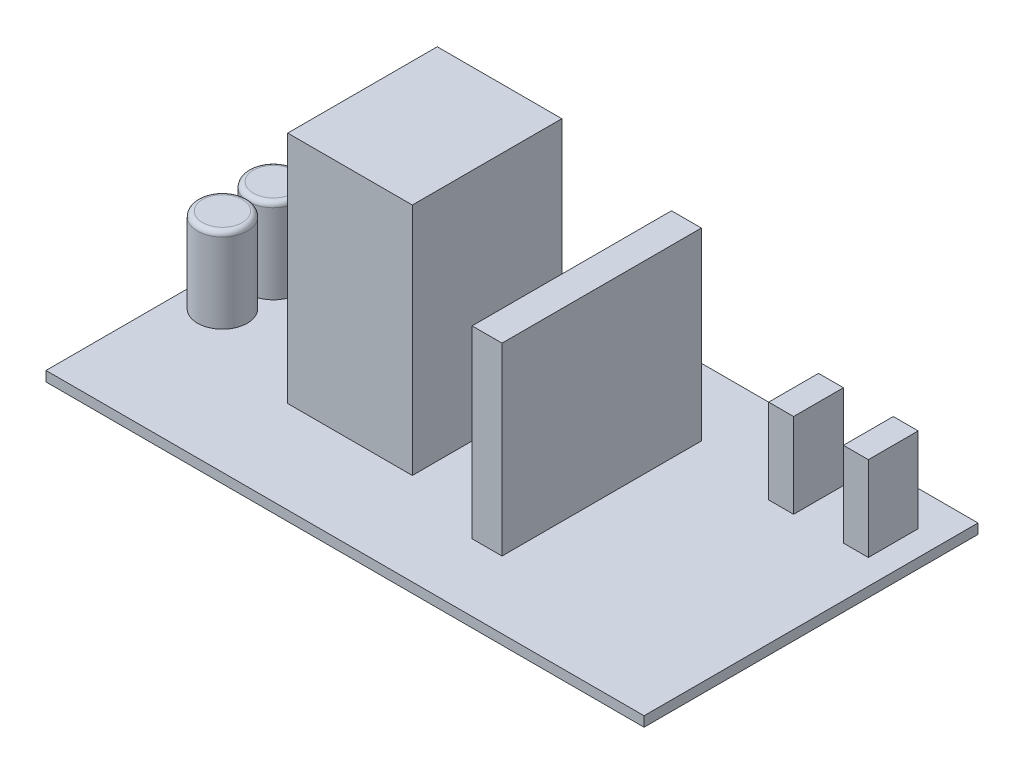
ISO-10303-21;
HEADER;
FILE_DESCRIPTION(('STEP AP214'),'2;1');
FILE_NAME('part.step','',(''),(''),'','','');
FILE_SCHEMA(('AUTOMOTIVE_DESIGN { 1 0 10303 214 1 1 1 1 }'));
ENDSEC;
DATA;
#1=APPLICATION_CONTEXT('core data for automotive mechanical design processes');
#2=APPLICATION_PROTOCOL_DEFINITION('international standard','automotive_design',2000,#1);
#3=PRODUCT_CONTEXT('',#1,'mechanical');
#4=PRODUCT('Part','Part','',(#3));
#5=PRODUCT_RELATED_PRODUCT_CATEGORY('part','',(#4));
#6=PRODUCT_DEFINITION_FORMATION('','',#4);
#7=PRODUCT_DEFINITION_CONTEXT('part definition',#1,'design');
#8=PRODUCT_DEFINITION('design','',#6,#7);
#9=PRODUCT_DEFINITION_SHAPE('','',#8);
#10=(LENGTH_UNIT() NAMED_UNIT(*) SI_UNIT(.MILLI.,.METRE.));
#11=(NAMED_UNIT(*) PLANE_ANGLE_UNIT() SI_UNIT($,.RADIAN.));
#12=(NAMED_UNIT(*) SI_UNIT($,.STERADIAN.) SOLID_ANGLE_UNIT());
#13=UNCERTAINTY_MEASURE_WITH_UNIT(LENGTH_MEASURE(1.E-05),#10,'distance_accuracy_value','');
#14=(GEOMETRIC_REPRESENTATION_CONTEXT(3) GLOBAL_UNCERTAINTY_ASSIGNED_CONTEXT((#13)) GLOBAL_UNIT_ASSIGNED_CONTEXT((#10,
#11,#12)) REPRESENTATION_CONTEXT('',''));
#15=CARTESIAN_POINT('',(0.,0.,0.));
#16=DIRECTION('',(0.,0.,1.));
#17=DIRECTION('',(1.,0.,0.));
#18=AXIS2_PLACEMENT_3D('',#15,#16,#17);
#19=CARTESIAN_POINT('',(0.,2.,0.));
#20=DIRECTION('',(0.,1.,0.));
#21=DIRECTION('',(0.,0.,1.));
#22=AXIS2_PLACEMENT_3D('',#19,#20,#21);
#23=PLANE('',#22);
#24=DIRECTION('',(0.,0.,1.));
#25=VECTOR('',#24,1.);
#26=CARTESIAN_POINT('',(35.,2.,0.));
#27=LINE('',#26,#25);
#28=CARTESIAN_POINT('',(35.,2.,-26.5));
#29=VERTEX_POINT('',#28);
#30=CARTESIAN_POINT('',(35.,2.,-16.5));
#31=VERTEX_POINT('',#30);
#32=EDGE_CURVE('E196',#29,#31,#27,.T.);
#33=ORIENTED_EDGE('',*,*,#32,.F.);
#34=DIRECTION('',(-1.,0.,0.));
#35=VECTOR('',#34,1.);
#36=CARTESIAN_POINT('',(0.,2.,-26.5));
#37=LINE('',#36,#35);
#38=CARTESIAN_POINT('',(40.,2.,-26.5));
#39=VERTEX_POINT('',#38);
#40=EDGE_CURVE('E193',#39,#29,#37,.T.);
#41=ORIENTED_EDGE('',*,*,#40,.F.);
#42=DIRECTION('',(0.,0.,1.));
#43=VECTOR('',#42,1.);
#44=CARTESIAN_POINT('',(40.,2.,0.));
#45=LINE('',#44,#43);
#46=CARTESIAN_POINT('',(40.,2.,-16.5));
#47=VERTEX_POINT('',#46);
#48=EDGE_CURVE('E206',#39,#47,#45,.T.);
#49=ORIENTED_EDGE('',*,*,#48,.T.);
#50=DIRECTION('',(-1.,0.,0.));
#51=VECTOR('',#50,1.);
#52=CARTESIAN_POINT('',(0.,2.,-16.5));
#53=LINE('',#52,#51);
#54=EDGE_CURVE('E217',#47,#31,#53,.T.);
#55=ORIENTED_EDGE('',*,*,#54,.T.);
#56=EDGE_LOOP('',(#33,#41,#49,#55));
#57=FACE_BOUND('',#56,.T.);
#58=DIRECTION('',(0.,0.,1.));
#59=VECTOR('',#58,1.);
#60=CARTESIAN_POINT('',(18.,2.,0.));
#61=LINE('',#60,#59);
#62=CARTESIAN_POINT('',(18.,2.,-20.));
#63=VERTEX_POINT('',#62);
#64=CARTESIAN_POINT('',(18.,2.,20.));
#65=VERTEX_POINT('',#64);
#66=EDGE_CURVE('E231',#63,#65,#61,.T.);
#67=ORIENTED_EDGE('',*,*,#66,.T.);
#68=DIRECTION('',(1.,0.,0.));
#69=VECTOR('',#68,1.);
#70=CARTESIAN_POINT('',(0.,2.,20.));
#71=LINE('',#70,#69);
#72=CARTESIAN_POINT('',(12.,2.,20.));
#73=VERTEX_POINT('',#72);
#74=EDGE_CURVE('E236',#73,#65,#71,.T.);
#75=ORIENTED_EDGE('',*,*,#74,.F.);
#76=DIRECTION('',(0.,0.,1.));
#77=VECTOR('',#76,1.);
#78=CARTESIAN_POINT('',(12.,2.,0.));
#79=LINE('',#78,#77);
#80=CARTESIAN_POINT('',(12.,2.,-20.));
#81=VERTEX_POINT('',#80);
#82=EDGE_CURVE('E249',#81,#73,#79,.T.);
#83=ORIENTED_EDGE('',*,*,#82,.F.);
#84=DIRECTION('',(1.,0.,0.));
#85=VECTOR('',#84,1.);
#86=CARTESIAN_POINT('',(0.,2.,-20.));
#87=LINE('',#86,#85);
#88=EDGE_CURVE('E246',#81,#63,#87,.T.);
#89=ORIENTED_EDGE('',*,*,#88,.T.);
#90=EDGE_LOOP('',(#67,#75,#83,#89));
#91=FACE_BOUND('',#90,.T.);
#92=DIRECTION('',(0.,0.,1.));
#93=VECTOR('',#92,1.);
#94=CARTESIAN_POINT('',(-5.,2.,0.));
#95=LINE('',#94,#93);
#96=CARTESIAN_POINT('',(-5.,2.,-15.));
#97=VERTEX_POINT('',#96);
#98=CARTESIAN_POINT('',(-5.,2.,15.));
#99=VERTEX_POINT('',#98);
#100=EDGE_CURVE('E261',#97,#99,#95,.T.);
#101=ORIENTED_EDGE('',*,*,#100,.T.);
#102=DIRECTION('',(1.,0.,0.));
#103=VECTOR('',#102,1.);
#104=CARTESIAN_POINT('',(0.,2.,15.));
#105=LINE('',#104,#103);
#106=CARTESIAN_POINT('',(-30.,2.,15.));
#107=VERTEX_POINT('',#106);
#108=EDGE_CURVE('E266',#107,#99,#105,.T.);
#109=ORIENTED_EDGE('',*,*,#108,.F.);
#110=DIRECTION('',(0.,0.,1.));
#111=VECTOR('',#110,1.);
#112=CARTESIAN_POINT('',(-30.,2.,0.));
#113=LINE('',#112,#111);
#114=CARTESIAN_POINT('',(-30.,2.,-15.));
#115=VERTEX_POINT('',#114);
#116=EDGE_CURVE('E279',#115,#107,#113,.T.);
#117=ORIENTED_EDGE('',*,*,#116,.F.);
#118=DIRECTION('',(1.,0.,0.));
#119=VECTOR('',#118,1.);
#120=CARTESIAN_POINT('',(0.,2.,-15.));
#121=LINE('',#120,#119);
#122=EDGE_CURVE('E276',#115,#97,#121,.T.);
#123=ORIENTED_EDGE('',*,*,#122,.T.);
#124=EDGE_LOOP('',(#101,#109,#117,#123));
#125=FACE_BOUND('',#124,.T.);
#126=CARTESIAN_POINT('',(-53.,2.,-5.1));
#127=DIRECTION('',(0.,1.,0.));
#128=DIRECTION('',(0.,0.,1.));
#129=AXIS2_PLACEMENT_3D('',#126,#127,#128);
#130=CIRCLE('',#129,5.);
#131=CARTESIAN_POINT('',(-53.,2.,-0.100000000000002));
#132=VERTEX_POINT('',#131);
#133=EDGE_CURVE('E294',#132,#132,#130,.T.);
#134=ORIENTED_EDGE('',*,*,#133,.F.);
#135=EDGE_LOOP('',(#134));
#136=FACE_BOUND('',#135,.T.);
#137=DIRECTION('',(0.,0.,-1.));
#138=VECTOR('',#137,1.);
#139=CARTESIAN_POINT('',(60.,2.,-33.5));
#140=LINE('',#139,#138);
#141=CARTESIAN_POINT('',(60.,2.,33.5));
#142=VERTEX_POINT('',#141);
#143=CARTESIAN_POINT('',(60.,2.,-33.5));
#144=VERTEX_POINT('',#143);
#145=EDGE_CURVE('E298',#142,#144,#140,.T.);
#146=ORIENTED_EDGE('',*,*,#145,.T.);
#147=DIRECTION('',(-1.,0.,0.));
#148=VECTOR('',#147,1.);
#149=CARTESIAN_POINT('',(-60.,2.,-33.5));
#150=LINE('',#149,#148);
#151=CARTESIAN_POINT('',(-60.,2.,-33.5));
#152=VERTEX_POINT('',#151);
#153=EDGE_CURVE('E301',#144,#152,#150,.T.);
#154=ORIENTED_EDGE('',*,*,#153,.T.);
#155=DIRECTION('',(0.,0.,1.));
#156=VECTOR('',#155,1.);
#157=CARTESIAN_POINT('',(-60.,2.,-33.5));
#158=LINE('',#157,#156);
#159=CARTESIAN_POINT('',(-60.,2.,33.5));
#160=VERTEX_POINT('',#159);
#161=EDGE_CURVE('E304',#152,#160,#158,.T.);
#162=ORIENTED_EDGE('',*,*,#161,.T.);
#163=DIRECTION('',(1.,0.,0.));
#164=VECTOR('',#163,1.);
#165=CARTESIAN_POINT('',(-60.,2.,33.5));
#166=LINE('',#165,#164);
#167=EDGE_CURVE('E306',#160,#142,#166,.T.);
#168=ORIENTED_EDGE('',*,*,#167,.T.);
#169=EDGE_LOOP('',(#146,#154,#162,#168));
#170=FACE_BOUND('',#169,.T.);
#171=CARTESIAN_POINT('',(-53.,2.,5.1));
#172=DIRECTION('',(0.,1.,0.));
#173=DIRECTION('',(0.,0.,1.));
#174=AXIS2_PLACEMENT_3D('',#171,#172,#173);
#175=CIRCLE('',#174,5.);
#176=CARTESIAN_POINT('',(-53.,2.,10.1));
#177=VERTEX_POINT('',#176);
#178=EDGE_CURVE('E291',#177,#177,#175,.T.);
#179=ORIENTED_EDGE('',*,*,#178,.F.);
#180=EDGE_LOOP('',(#179));
#181=FACE_BOUND('',#180,.T.);
#182=DIRECTION('',(0.,0.,1.));
#183=VECTOR('',#182,1.);
#184=CARTESIAN_POINT('',(50.,2.,0.));
#185=LINE('',#184,#183);
#186=CARTESIAN_POINT('',(50.,2.,-26.5));
#187=VERTEX_POINT('',#186);
#188=CARTESIAN_POINT('',(50.,2.,-16.5));
#189=VERTEX_POINT('',#188);
#190=EDGE_CURVE('E49',#187,#189,#185,.T.);
#191=ORIENTED_EDGE('',*,*,#190,.F.);
#192=DIRECTION('',(-1.,0.,0.));
#193=VECTOR('',#192,1.);
#194=CARTESIAN_POINT('',(0.,2.,-26.5));
#195=LINE('',#194,#193);
#196=CARTESIAN_POINT('',(55.,2.,-26.5));
#197=VERTEX_POINT('',#196);
#198=EDGE_CURVE('E192',#197,#187,#195,.T.);
#199=ORIENTED_EDGE('',*,*,#198,.F.);
#200=DIRECTION('',(0.,0.,1.));
#201=VECTOR('',#200,1.);
#202=CARTESIAN_POINT('',(55.,2.,0.));
#203=LINE('',#202,#201);
#204=CARTESIAN_POINT('',(55.,2.,-16.5));
#205=VERTEX_POINT('',#204);
#206=EDGE_CURVE('E189',#197,#205,#203,.T.);
#207=ORIENTED_EDGE('',*,*,#206,.T.);
#208=DIRECTION('',(-1.,0.,0.));
#209=VECTOR('',#208,1.);
#210=CARTESIAN_POINT('',(0.,2.,-16.5));
#211=LINE('',#210,#209);
#212=EDGE_CURVE('E54',#205,#189,#211,.T.);
#213=ORIENTED_EDGE('',*,*,#212,.T.);
#214=EDGE_LOOP('',(#191,#199,#207,#213));
#215=FACE_BOUND('',#214,.T.);
#216=ADVANCED_FACE('F34',(#57,#91,#125,#136,#170,#181,#215),#23,.T.);
#217=CARTESIAN_POINT('',(60.,2.,-33.5));
#218=DIRECTION('',(-1.,0.,0.));
#219=DIRECTION('',(0.,0.,1.));
#220=AXIS2_PLACEMENT_3D('',#217,#218,#219);
#221=PLANE('',#220);
#222=DIRECTION('',(0.,0.,-1.));
#223=VECTOR('',#222,1.);
#224=CARTESIAN_POINT('',(60.,0.,-33.5));
#225=LINE('',#224,#223);
#226=CARTESIAN_POINT('',(60.,0.,33.5));
#227=VERTEX_POINT('',#226);
#228=CARTESIAN_POINT('',(60.,0.,-33.5));
#229=VERTEX_POINT('',#228);
#230=EDGE_CURVE('E297',#227,#229,#225,.T.);
#231=ORIENTED_EDGE('',*,*,#230,.T.);
#232=DIRECTION('',(0.,-1.,0.));
#233=VECTOR('',#232,1.);
#234=CARTESIAN_POINT('',(60.,2.,-33.5));
#235=LINE('',#234,#233);
#236=EDGE_CURVE('E324',#144,#229,#235,.T.);
#237=ORIENTED_EDGE('',*,*,#236,.F.);
#238=ORIENTED_EDGE('',*,*,#145,.F.);
#239=DIRECTION('',(0.,-1.,0.));
#240=VECTOR('',#239,1.);
#241=CARTESIAN_POINT('',(60.,2.,33.5));
#242=LINE('',#241,#240);
#243=EDGE_CURVE('E308',#142,#227,#242,.T.);
#244=ORIENTED_EDGE('',*,*,#243,.T.);
#245=EDGE_LOOP('',(#231,#237,#238,#244));
#246=FACE_BOUND('',#245,.T.);
#247=ADVANCED_FACE('F352',(#246),#221,.F.);
#248=CARTESIAN_POINT('',(-60.,2.,-33.5));
#249=DIRECTION('',(0.,0.,1.));
#250=DIRECTION('',(1.,0.,0.));
#251=AXIS2_PLACEMENT_3D('',#248,#249,#250);
#252=PLANE('',#251);
#253=DIRECTION('',(-1.,0.,0.));
#254=VECTOR('',#253,1.);
#255=CARTESIAN_POINT('',(-60.,0.,-33.5));
#256=LINE('',#255,#254);
#257=CARTESIAN_POINT('',(-60.,0.,-33.5));
#258=VERTEX_POINT('',#257);
#259=EDGE_CURVE('E311',#229,#258,#256,.T.);
#260=ORIENTED_EDGE('',*,*,#259,.T.);
#261=DIRECTION('',(0.,-1.,0.));
#262=VECTOR('',#261,1.);
#263=CARTESIAN_POINT('',(-60.,2.,-33.5));
#264=LINE('',#263,#262);
#265=EDGE_CURVE('E321',#152,#258,#264,.T.);
#266=ORIENTED_EDGE('',*,*,#265,.F.);
#267=ORIENTED_EDGE('',*,*,#153,.F.);
#268=ORIENTED_EDGE('',*,*,#236,.T.);
#269=EDGE_LOOP('',(#260,#266,#267,#268));
#270=FACE_BOUND('',#269,.T.);
#271=ADVANCED_FACE('F358',(#270),#252,.F.);
#272=CARTESIAN_POINT('',(-60.,2.,-33.5));
#273=DIRECTION('',(1.,0.,0.));
#274=DIRECTION('',(0.,0.,-1.));
#275=AXIS2_PLACEMENT_3D('',#272,#273,#274);
#276=PLANE('',#275);
#277=DIRECTION('',(0.,0.,1.));
#278=VECTOR('',#277,1.);
#279=CARTESIAN_POINT('',(-60.,0.,-33.5));
#280=LINE('',#279,#278);
#281=CARTESIAN_POINT('',(-60.,0.,33.5));
#282=VERTEX_POINT('',#281);
#283=EDGE_CURVE('E313',#258,#282,#280,.T.);
#284=ORIENTED_EDGE('',*,*,#283,.T.);
#285=DIRECTION('',(0.,-1.,0.));
#286=VECTOR('',#285,1.);
#287=CARTESIAN_POINT('',(-60.,2.,33.5));
#288=LINE('',#287,#286);
#289=EDGE_CURVE('E318',#160,#282,#288,.T.);
#290=ORIENTED_EDGE('',*,*,#289,.F.);
#291=ORIENTED_EDGE('',*,*,#161,.F.);
#292=ORIENTED_EDGE('',*,*,#265,.T.);
#293=EDGE_LOOP('',(#284,#290,#291,#292));
#294=FACE_BOUND('',#293,.T.);
#295=ADVANCED_FACE('F373',(#294),#276,.F.);
#296=CARTESIAN_POINT('',(-60.,2.,33.5));
#297=DIRECTION('',(0.,0.,-1.));
#298=DIRECTION('',(-1.,0.,0.));
#299=AXIS2_PLACEMENT_3D('',#296,#297,#298);
#300=PLANE('',#299);
#301=DIRECTION('',(1.,0.,0.));
#302=VECTOR('',#301,1.);
#303=CARTESIAN_POINT('',(-60.,0.,33.5));
#304=LINE('',#303,#302);
#305=EDGE_CURVE('E302',#282,#227,#304,.T.);
#306=ORIENTED_EDGE('',*,*,#305,.T.);
#307=ORIENTED_EDGE('',*,*,#243,.F.);
#308=ORIENTED_EDGE('',*,*,#167,.F.);
#309=ORIENTED_EDGE('',*,*,#289,.T.);
#310=EDGE_LOOP('',(#306,#307,#308,#309));
#311=FACE_BOUND('',#310,.T.);
#312=ADVANCED_FACE('F369',(#311),#300,.F.);
#313=CARTESIAN_POINT('',(0.,0.,0.));
#314=DIRECTION('',(0.,1.,0.));
#315=DIRECTION('',(0.,0.,1.));
#316=AXIS2_PLACEMENT_3D('',#313,#314,#315);
#317=PLANE('',#316);
#318=ORIENTED_EDGE('',*,*,#230,.F.);
#319=ORIENTED_EDGE('',*,*,#305,.F.);
#320=ORIENTED_EDGE('',*,*,#283,.F.);
#321=ORIENTED_EDGE('',*,*,#259,.F.);
#322=EDGE_LOOP('',(#318,#319,#320,#321));
#323=FACE_BOUND('',#322,.T.);
#324=ADVANCED_FACE('F366',(#323),#317,.F.);
#325=CARTESIAN_POINT('',(-53.,19.,-5.1));
#326=DIRECTION('',(0.,-1.,0.));
#327=DIRECTION('',(0.,0.,-1.));
#328=AXIS2_PLACEMENT_3D('',#325,#326,#327);
#329=CYLINDRICAL_SURFACE('',#328,5.);
#330=CARTESIAN_POINT('',(-53.,18.,-5.1));
#331=DIRECTION('',(0.,1.,0.));
#332=DIRECTION('',(0.,0.,1.));
#333=AXIS2_PLACEMENT_3D('',#330,#331,#332);
#334=CIRCLE('',#333,5.);
#335=CARTESIAN_POINT('',(-53.,18.,-0.100000000000002));
#336=VERTEX_POINT('',#335);
#337=EDGE_CURVE('E11',#336,#336,#334,.F.);
#338=ORIENTED_EDGE('',*,*,#337,.T.);
#339=EDGE_LOOP('',(#338));
#340=FACE_BOUND('',#339,.T.);
#341=ORIENTED_EDGE('',*,*,#133,.T.);
#342=EDGE_LOOP('',(#341));
#343=FACE_BOUND('',#342,.T.);
#344=ADVANCED_FACE('F364',(#340,#343),#329,.T.);
#345=CARTESIAN_POINT('',(-53.,19.,-5.1));
#346=DIRECTION('',(0.,1.,0.));
#347=DIRECTION('',(0.,0.,1.));
#348=AXIS2_PLACEMENT_3D('',#345,#346,#347);
#349=PLANE('',#348);
#350=CARTESIAN_POINT('',(-53.,19.,-5.1));
#351=DIRECTION('',(0.,1.,0.));
#352=DIRECTION('',(0.,0.,1.));
#353=AXIS2_PLACEMENT_3D('',#350,#351,#352);
#354=CIRCLE('',#353,4.);
#355=CARTESIAN_POINT('',(-53.,19.,-1.1));
#356=VERTEX_POINT('',#355);
#357=EDGE_CURVE('E42',#356,#356,#354,.T.);
#358=ORIENTED_EDGE('',*,*,#357,.T.);
#359=EDGE_LOOP('',(#358));
#360=FACE_BOUND('',#359,.T.);
#361=ADVANCED_FACE('F335',(#360),#349,.T.);
#362=CARTESIAN_POINT('',(-53.,19.,5.1));
#363=DIRECTION('',(0.,-1.,0.));
#364=DIRECTION('',(0.,0.,-1.));
#365=AXIS2_PLACEMENT_3D('',#362,#363,#364);
#366=CYLINDRICAL_SURFACE('',#365,5.);
#367=CARTESIAN_POINT('',(-53.,18.,5.1));
#368=DIRECTION('',(0.,1.,0.));
#369=DIRECTION('',(0.,0.,1.));
#370=AXIS2_PLACEMENT_3D('',#367,#368,#369);
#371=CIRCLE('',#370,5.);
#372=CARTESIAN_POINT('',(-53.,18.,10.1));
#373=VERTEX_POINT('',#372);
#374=EDGE_CURVE('E330',#373,#373,#371,.F.);
#375=ORIENTED_EDGE('',*,*,#374,.T.);
#376=EDGE_LOOP('',(#375));
#377=FACE_BOUND('',#376,.T.);
#378=ORIENTED_EDGE('',*,*,#178,.T.);
#379=EDGE_LOOP('',(#378));
#380=FACE_BOUND('',#379,.T.);
#381=ADVANCED_FACE('F396',(#377,#380),#366,.T.);
#382=CARTESIAN_POINT('',(-53.,19.,5.1));
#383=DIRECTION('',(0.,1.,0.));
#384=DIRECTION('',(0.,0.,1.));
#385=AXIS2_PLACEMENT_3D('',#382,#383,#384);
#386=PLANE('',#385);
#387=CARTESIAN_POINT('',(-53.,19.,5.1));
#388=DIRECTION('',(0.,1.,0.));
#389=DIRECTION('',(0.,0.,1.));
#390=AXIS2_PLACEMENT_3D('',#387,#388,#389);
#391=CIRCLE('',#390,4.);
#392=CARTESIAN_POINT('',(-53.,19.,9.1));
#393=VERTEX_POINT('',#392);
#394=EDGE_CURVE('E327',#393,#393,#391,.T.);
#395=ORIENTED_EDGE('',*,*,#394,.T.);
#396=EDGE_LOOP('',(#395));
#397=FACE_BOUND('',#396,.T.);
#398=ADVANCED_FACE('F348',(#397),#386,.T.);
#399=CARTESIAN_POINT('',(-53.,18.,5.1));
#400=DIRECTION('',(0.,1.,0.));
#401=DIRECTION('',(0.,0.,1.));
#402=AXIS2_PLACEMENT_3D('',#399,#400,#401);
#403=TOROIDAL_SURFACE('',#402,4.,1.);
#404=ORIENTED_EDGE('',*,*,#374,.F.);
#405=EDGE_LOOP('',(#404));
#406=FACE_BOUND('',#405,.T.);
#407=ORIENTED_EDGE('',*,*,#394,.F.);
#408=EDGE_LOOP('',(#407));
#409=FACE_BOUND('',#408,.T.);
#410=ADVANCED_FACE('F339',(#406,#409),#403,.T.);
#411=CARTESIAN_POINT('',(-53.,18.,-5.1));
#412=DIRECTION('',(0.,1.,0.));
#413=DIRECTION('',(0.,0.,1.));
#414=AXIS2_PLACEMENT_3D('',#411,#412,#413);
#415=TOROIDAL_SURFACE('',#414,4.,1.);
#416=ORIENTED_EDGE('',*,*,#337,.F.);
#417=EDGE_LOOP('',(#416));
#418=FACE_BOUND('',#417,.T.);
#419=ORIENTED_EDGE('',*,*,#357,.F.);
#420=EDGE_LOOP('',(#419));
#421=FACE_BOUND('',#420,.T.);
#422=ADVANCED_FACE('F36',(#418,#421),#415,.T.);
#423=CARTESIAN_POINT('',(-5.,49.,0.));
#424=DIRECTION('',(1.,0.,0.));
#425=DIRECTION('',(0.,0.,-1.));
#426=AXIS2_PLACEMENT_3D('',#423,#424,#425);
#427=PLANE('',#426);
#428=ORIENTED_EDGE('',*,*,#100,.F.);
#429=DIRECTION('',(0.,-1.,0.));
#430=VECTOR('',#429,1.);
#431=CARTESIAN_POINT('',(-5.,49.,-15.));
#432=LINE('',#431,#430);
#433=CARTESIAN_POINT('',(-5.,49.,-15.));
#434=VERTEX_POINT('',#433);
#435=EDGE_CURVE('E289',#434,#97,#432,.T.);
#436=ORIENTED_EDGE('',*,*,#435,.F.);
#437=DIRECTION('',(0.,0.,1.));
#438=VECTOR('',#437,1.);
#439=CARTESIAN_POINT('',(-5.,49.,0.));
#440=LINE('',#439,#438);
#441=CARTESIAN_POINT('',(-5.,49.,15.));
#442=VERTEX_POINT('',#441);
#443=EDGE_CURVE('E262',#434,#442,#440,.T.);
#444=ORIENTED_EDGE('',*,*,#443,.T.);
#445=DIRECTION('',(0.,-1.,0.));
#446=VECTOR('',#445,1.);
#447=CARTESIAN_POINT('',(-5.,49.,15.));
#448=LINE('',#447,#446);
#449=EDGE_CURVE('E273',#442,#99,#448,.T.);
#450=ORIENTED_EDGE('',*,*,#449,.T.);
#451=EDGE_LOOP('',(#428,#436,#444,#450));
#452=FACE_BOUND('',#451,.T.);
#453=ADVANCED_FACE('F338',(#452),#427,.T.);
#454=CARTESIAN_POINT('',(0.,49.,-15.));
#455=DIRECTION('',(0.,0.,-1.));
#456=DIRECTION('',(-1.,0.,0.));
#457=AXIS2_PLACEMENT_3D('',#454,#455,#456);
#458=PLANE('',#457);
#459=ORIENTED_EDGE('',*,*,#122,.F.);
#460=DIRECTION('',(0.,-1.,0.));
#461=VECTOR('',#460,1.);
#462=CARTESIAN_POINT('',(-30.,49.,-15.));
#463=LINE('',#462,#461);
#464=CARTESIAN_POINT('',(-30.,49.,-15.));
#465=VERTEX_POINT('',#464);
#466=EDGE_CURVE('E287',#465,#115,#463,.T.);
#467=ORIENTED_EDGE('',*,*,#466,.F.);
#468=DIRECTION('',(1.,0.,0.));
#469=VECTOR('',#468,1.);
#470=CARTESIAN_POINT('',(0.,49.,-15.));
#471=LINE('',#470,#469);
#472=EDGE_CURVE('E265',#465,#434,#471,.T.);
#473=ORIENTED_EDGE('',*,*,#472,.T.);
#474=ORIENTED_EDGE('',*,*,#435,.T.);
#475=EDGE_LOOP('',(#459,#467,#473,#474));
#476=FACE_BOUND('',#475,.T.);
#477=ADVANCED_FACE('F345',(#476),#458,.T.);
#478=CARTESIAN_POINT('',(-30.,49.,0.));
#479=DIRECTION('',(1.,0.,0.));
#480=DIRECTION('',(0.,0.,-1.));
#481=AXIS2_PLACEMENT_3D('',#478,#479,#480);
#482=PLANE('',#481);
#483=ORIENTED_EDGE('',*,*,#116,.T.);
#484=DIRECTION('',(0.,-1.,0.));
#485=VECTOR('',#484,1.);
#486=CARTESIAN_POINT('',(-30.,49.,15.));
#487=LINE('',#486,#485);
#488=CARTESIAN_POINT('',(-30.,49.,15.));
#489=VERTEX_POINT('',#488);
#490=EDGE_CURVE('E285',#489,#107,#487,.T.);
#491=ORIENTED_EDGE('',*,*,#490,.F.);
#492=DIRECTION('',(0.,0.,1.));
#493=VECTOR('',#492,1.);
#494=CARTESIAN_POINT('',(-30.,49.,0.));
#495=LINE('',#494,#493);
#496=EDGE_CURVE('E269',#465,#489,#495,.T.);
#497=ORIENTED_EDGE('',*,*,#496,.F.);
#498=ORIENTED_EDGE('',*,*,#466,.T.);
#499=EDGE_LOOP('',(#483,#491,#497,#498));
#500=FACE_BOUND('',#499,.T.);
#501=ADVANCED_FACE('F409',(#500),#482,.F.);
#502=CARTESIAN_POINT('',(0.,49.,15.));
#503=DIRECTION('',(0.,0.,-1.));
#504=DIRECTION('',(-1.,0.,0.));
#505=AXIS2_PLACEMENT_3D('',#502,#503,#504);
#506=PLANE('',#505);
#507=ORIENTED_EDGE('',*,*,#108,.T.);
#508=ORIENTED_EDGE('',*,*,#449,.F.);
#509=DIRECTION('',(1.,0.,0.));
#510=VECTOR('',#509,1.);
#511=CARTESIAN_POINT('',(0.,49.,15.));
#512=LINE('',#511,#510);
#513=EDGE_CURVE('E271',#489,#442,#512,.T.);
#514=ORIENTED_EDGE('',*,*,#513,.F.);
#515=ORIENTED_EDGE('',*,*,#490,.T.);
#516=EDGE_LOOP('',(#507,#508,#514,#515));
#517=FACE_BOUND('',#516,.T.);
#518=ADVANCED_FACE('F413',(#517),#506,.F.);
#519=CARTESIAN_POINT('',(0.,49.,0.));
#520=DIRECTION('',(0.,1.,0.));
#521=DIRECTION('',(0.,0.,1.));
#522=AXIS2_PLACEMENT_3D('',#519,#520,#521);
#523=PLANE('',#522);
#524=ORIENTED_EDGE('',*,*,#443,.F.);
#525=ORIENTED_EDGE('',*,*,#472,.F.);
#526=ORIENTED_EDGE('',*,*,#496,.T.);
#527=ORIENTED_EDGE('',*,*,#513,.T.);
#528=EDGE_LOOP('',(#524,#525,#526,#527));
#529=FACE_BOUND('',#528,.T.);
#530=ADVANCED_FACE('F417',(#529),#523,.T.);
#531=CARTESIAN_POINT('',(18.,39.,0.));
#532=DIRECTION('',(1.,0.,0.));
#533=DIRECTION('',(0.,0.,-1.));
#534=AXIS2_PLACEMENT_3D('',#531,#532,#533);
#535=PLANE('',#534);
#536=ORIENTED_EDGE('',*,*,#66,.F.);
#537=DIRECTION('',(0.,-1.,0.));
#538=VECTOR('',#537,1.);
#539=CARTESIAN_POINT('',(18.,39.,-20.));
#540=LINE('',#539,#538);
#541=CARTESIAN_POINT('',(18.,39.,-20.));
#542=VERTEX_POINT('',#541);
#543=EDGE_CURVE('E259',#542,#63,#540,.T.);
#544=ORIENTED_EDGE('',*,*,#543,.F.);
#545=DIRECTION('',(0.,0.,1.));
#546=VECTOR('',#545,1.);
#547=CARTESIAN_POINT('',(18.,39.,0.));
#548=LINE('',#547,#546);
#549=CARTESIAN_POINT('',(18.,39.,20.));
#550=VERTEX_POINT('',#549);
#551=EDGE_CURVE('E232',#542,#550,#548,.T.);
#552=ORIENTED_EDGE('',*,*,#551,.T.);
#553=DIRECTION('',(0.,-1.,0.));
#554=VECTOR('',#553,1.);
#555=CARTESIAN_POINT('',(18.,39.,20.));
#556=LINE('',#555,#554);
#557=EDGE_CURVE('E243',#550,#65,#556,.T.);
#558=ORIENTED_EDGE('',*,*,#557,.T.);
#559=EDGE_LOOP('',(#536,#544,#552,#558));
#560=FACE_BOUND('',#559,.T.);
#561=ADVANCED_FACE('F421',(#560),#535,.T.);
#562=CARTESIAN_POINT('',(0.,39.,-20.));
#563=DIRECTION('',(0.,0.,-1.));
#564=DIRECTION('',(-1.,0.,0.));
#565=AXIS2_PLACEMENT_3D('',#562,#563,#564);
#566=PLANE('',#565);
#567=ORIENTED_EDGE('',*,*,#88,.F.);
#568=DIRECTION('',(0.,-1.,0.));
#569=VECTOR('',#568,1.);
#570=CARTESIAN_POINT('',(12.,39.,-20.));
#571=LINE('',#570,#569);
#572=CARTESIAN_POINT('',(12.,39.,-20.));
#573=VERTEX_POINT('',#572);
#574=EDGE_CURVE('E257',#573,#81,#571,.T.);
#575=ORIENTED_EDGE('',*,*,#574,.F.);
#576=DIRECTION('',(1.,0.,0.));
#577=VECTOR('',#576,1.);
#578=CARTESIAN_POINT('',(0.,39.,-20.));
#579=LINE('',#578,#577);
#580=EDGE_CURVE('E235',#573,#542,#579,.T.);
#581=ORIENTED_EDGE('',*,*,#580,.T.);
#582=ORIENTED_EDGE('',*,*,#543,.T.);
#583=EDGE_LOOP('',(#567,#575,#581,#582));
#584=FACE_BOUND('',#583,.T.);
#585=ADVANCED_FACE('F425',(#584),#566,.T.);
#586=CARTESIAN_POINT('',(12.,39.,0.));
#587=DIRECTION('',(1.,0.,0.));
#588=DIRECTION('',(0.,0.,-1.));
#589=AXIS2_PLACEMENT_3D('',#586,#587,#588);
#590=PLANE('',#589);
#591=ORIENTED_EDGE('',*,*,#82,.T.);
#592=DIRECTION('',(0.,-1.,0.));
#593=VECTOR('',#592,1.);
#594=CARTESIAN_POINT('',(12.,39.,20.));
#595=LINE('',#594,#593);
#596=CARTESIAN_POINT('',(12.,39.,20.));
#597=VERTEX_POINT('',#596);
#598=EDGE_CURVE('E255',#597,#73,#595,.T.);
#599=ORIENTED_EDGE('',*,*,#598,.F.);
#600=DIRECTION('',(0.,0.,1.));
#601=VECTOR('',#600,1.);
#602=CARTESIAN_POINT('',(12.,39.,0.));
#603=LINE('',#602,#601);
#604=EDGE_CURVE('E239',#573,#597,#603,.T.);
#605=ORIENTED_EDGE('',*,*,#604,.F.);
#606=ORIENTED_EDGE('',*,*,#574,.T.);
#607=EDGE_LOOP('',(#591,#599,#605,#606));
#608=FACE_BOUND('',#607,.T.);
#609=ADVANCED_FACE('F429',(#608),#590,.F.);
#610=CARTESIAN_POINT('',(0.,39.,20.));
#611=DIRECTION('',(0.,0.,-1.));
#612=DIRECTION('',(-1.,0.,0.));
#613=AXIS2_PLACEMENT_3D('',#610,#611,#612);
#614=PLANE('',#613);
#615=ORIENTED_EDGE('',*,*,#74,.T.);
#616=ORIENTED_EDGE('',*,*,#557,.F.);
#617=DIRECTION('',(1.,0.,0.));
#618=VECTOR('',#617,1.);
#619=CARTESIAN_POINT('',(0.,39.,20.));
#620=LINE('',#619,#618);
#621=EDGE_CURVE('E241',#597,#550,#620,.T.);
#622=ORIENTED_EDGE('',*,*,#621,.F.);
#623=ORIENTED_EDGE('',*,*,#598,.T.);
#624=EDGE_LOOP('',(#615,#616,#622,#623));
#625=FACE_BOUND('',#624,.T.);
#626=ADVANCED_FACE('F433',(#625),#614,.F.);
#627=CARTESIAN_POINT('',(0.,39.,0.));
#628=DIRECTION('',(0.,1.,0.));
#629=DIRECTION('',(0.,0.,1.));
#630=AXIS2_PLACEMENT_3D('',#627,#628,#629);
#631=PLANE('',#630);
#632=ORIENTED_EDGE('',*,*,#551,.F.);
#633=ORIENTED_EDGE('',*,*,#580,.F.);
#634=ORIENTED_EDGE('',*,*,#604,.T.);
#635=ORIENTED_EDGE('',*,*,#621,.T.);
#636=EDGE_LOOP('',(#632,#633,#634,#635));
#637=FACE_BOUND('',#636,.T.);
#638=ADVANCED_FACE('F437',(#637),#631,.T.);
#639=CARTESIAN_POINT('',(0.,19.,-26.5));
#640=DIRECTION('',(0.,0.,1.));
#641=DIRECTION('',(1.,0.,0.));
#642=AXIS2_PLACEMENT_3D('',#639,#640,#641);
#643=PLANE('',#642);
#644=ORIENTED_EDGE('',*,*,#40,.T.);
#645=DIRECTION('',(0.,-1.,0.));
#646=VECTOR('',#645,1.);
#647=CARTESIAN_POINT('',(35.,19.,-26.5));
#648=LINE('',#647,#646);
#649=CARTESIAN_POINT('',(35.,19.,-26.5));
#650=VERTEX_POINT('',#649);
#651=EDGE_CURVE('E228',#650,#29,#648,.T.);
#652=ORIENTED_EDGE('',*,*,#651,.F.);
#653=DIRECTION('',(-1.,0.,0.));
#654=VECTOR('',#653,1.);
#655=CARTESIAN_POINT('',(0.,19.,-26.5));
#656=LINE('',#655,#654);
#657=CARTESIAN_POINT('',(40.,19.,-26.5));
#658=VERTEX_POINT('',#657);
#659=EDGE_CURVE('E202',#658,#650,#656,.T.);
#660=ORIENTED_EDGE('',*,*,#659,.F.);
#661=DIRECTION('',(0.,-1.,0.));
#662=VECTOR('',#661,1.);
#663=CARTESIAN_POINT('',(40.,19.,-26.5));
#664=LINE('',#663,#662);
#665=EDGE_CURVE('E213',#658,#39,#664,.T.);
#666=ORIENTED_EDGE('',*,*,#665,.T.);
#667=EDGE_LOOP('',(#644,#652,#660,#666));
#668=FACE_BOUND('',#667,.T.);
#669=ADVANCED_FACE('F441',(#668),#643,.F.);
#670=CARTESIAN_POINT('',(35.,19.,0.));
#671=DIRECTION('',(1.,0.,0.));
#672=DIRECTION('',(0.,0.,-1.));
#673=AXIS2_PLACEMENT_3D('',#670,#671,#672);
#674=PLANE('',#673);
#675=ORIENTED_EDGE('',*,*,#32,.T.);
#676=DIRECTION('',(0.,-1.,0.));
#677=VECTOR('',#676,1.);
#678=CARTESIAN_POINT('',(35.,19.,-16.5));
#679=LINE('',#678,#677);
#680=CARTESIAN_POINT('',(35.,19.,-16.5));
#681=VERTEX_POINT('',#680);
#682=EDGE_CURVE('E225',#681,#31,#679,.T.);
#683=ORIENTED_EDGE('',*,*,#682,.F.);
#684=DIRECTION('',(0.,0.,1.));
#685=VECTOR('',#684,1.);
#686=CARTESIAN_POINT('',(35.,19.,0.));
#687=LINE('',#686,#685);
#688=EDGE_CURVE('E205',#650,#681,#687,.T.);
#689=ORIENTED_EDGE('',*,*,#688,.F.);
#690=ORIENTED_EDGE('',*,*,#651,.T.);
#691=EDGE_LOOP('',(#675,#683,#689,#690));
#692=FACE_BOUND('',#691,.T.);
#693=ADVANCED_FACE('F445',(#692),#674,.F.);
#694=CARTESIAN_POINT('',(0.,19.,-16.5));
#695=DIRECTION('',(0.,0.,1.));
#696=DIRECTION('',(1.,0.,0.));
#697=AXIS2_PLACEMENT_3D('',#694,#695,#696);
#698=PLANE('',#697);
#699=ORIENTED_EDGE('',*,*,#54,.F.);
#700=DIRECTION('',(0.,-1.,0.));
#701=VECTOR('',#700,1.);
#702=CARTESIAN_POINT('',(40.,19.,-16.5));
#703=LINE('',#702,#701);
#704=CARTESIAN_POINT('',(40.,19.,-16.5));
#705=VERTEX_POINT('',#704);
#706=EDGE_CURVE('E222',#705,#47,#703,.T.);
#707=ORIENTED_EDGE('',*,*,#706,.F.);
#708=DIRECTION('',(-1.,0.,0.));
#709=VECTOR('',#708,1.);
#710=CARTESIAN_POINT('',(0.,19.,-16.5));
#711=LINE('',#710,#709);
#712=EDGE_CURVE('E208',#705,#681,#711,.T.);
#713=ORIENTED_EDGE('',*,*,#712,.T.);
#714=ORIENTED_EDGE('',*,*,#682,.T.);
#715=EDGE_LOOP('',(#699,#707,#713,#714));
#716=FACE_BOUND('',#715,.T.);
#717=ADVANCED_FACE('F449',(#716),#698,.T.);
#718=CARTESIAN_POINT('',(40.,19.,0.));
#719=DIRECTION('',(1.,0.,0.));
#720=DIRECTION('',(0.,0.,-1.));
#721=AXIS2_PLACEMENT_3D('',#718,#719,#720);
#722=PLANE('',#721);
#723=ORIENTED_EDGE('',*,*,#48,.F.);
#724=ORIENTED_EDGE('',*,*,#665,.F.);
#725=DIRECTION('',(0.,0.,1.));
#726=VECTOR('',#725,1.);
#727=CARTESIAN_POINT('',(40.,19.,0.));
#728=LINE('',#727,#726);
#729=EDGE_CURVE('E211',#658,#705,#728,.T.);
#730=ORIENTED_EDGE('',*,*,#729,.T.);
#731=ORIENTED_EDGE('',*,*,#706,.T.);
#732=EDGE_LOOP('',(#723,#724,#730,#731));
#733=FACE_BOUND('',#732,.T.);
#734=ADVANCED_FACE('F453',(#733),#722,.T.);
#735=CARTESIAN_POINT('',(0.,19.,0.));
#736=DIRECTION('',(0.,1.,0.));
#737=DIRECTION('',(0.,0.,1.));
#738=AXIS2_PLACEMENT_3D('',#735,#736,#737);
#739=PLANE('',#738);
#740=ORIENTED_EDGE('',*,*,#659,.T.);
#741=ORIENTED_EDGE('',*,*,#688,.T.);
#742=ORIENTED_EDGE('',*,*,#712,.F.);
#743=ORIENTED_EDGE('',*,*,#729,.F.);
#744=EDGE_LOOP('',(#740,#741,#742,#743));
#745=FACE_BOUND('',#744,.T.);
#746=ADVANCED_FACE('F457',(#745),#739,.T.);
#747=CARTESIAN_POINT('',(0.,19.,-26.5));
#748=DIRECTION('',(0.,0.,1.));
#749=DIRECTION('',(1.,0.,0.));
#750=AXIS2_PLACEMENT_3D('',#747,#748,#749);
#751=PLANE('',#750);
#752=ORIENTED_EDGE('',*,*,#198,.T.);
#753=DIRECTION('',(0.,-1.,0.));
#754=VECTOR('',#753,1.);
#755=CARTESIAN_POINT('',(50.,19.,-26.5));
#756=LINE('',#755,#754);
#757=CARTESIAN_POINT('',(50.,19.,-26.5));
#758=VERTEX_POINT('',#757);
#759=EDGE_CURVE('E173',#758,#187,#756,.T.);
#760=ORIENTED_EDGE('',*,*,#759,.F.);
#761=DIRECTION('',(-1.,0.,0.));
#762=VECTOR('',#761,1.);
#763=CARTESIAN_POINT('',(0.,19.,-26.5));
#764=LINE('',#763,#762);
#765=CARTESIAN_POINT('',(55.,19.,-26.5));
#766=VERTEX_POINT('',#765);
#767=EDGE_CURVE('E180',#766,#758,#764,.T.);
#768=ORIENTED_EDGE('',*,*,#767,.F.);
#769=DIRECTION('',(0.,-1.,0.));
#770=VECTOR('',#769,1.);
#771=CARTESIAN_POINT('',(55.,19.,-26.5));
#772=LINE('',#771,#770);
#773=EDGE_CURVE('E724',#766,#197,#772,.T.);
#774=ORIENTED_EDGE('',*,*,#773,.T.);
#775=EDGE_LOOP('',(#752,#760,#768,#774));
#776=FACE_BOUND('',#775,.T.);
#777=ADVANCED_FACE('F191',(#776),#751,.F.);
#778=CARTESIAN_POINT('',(50.,19.,0.));
#779=DIRECTION('',(1.,0.,0.));
#780=DIRECTION('',(0.,0.,-1.));
#781=AXIS2_PLACEMENT_3D('',#778,#779,#780);
#782=PLANE('',#781);
#783=ORIENTED_EDGE('',*,*,#190,.T.);
#784=DIRECTION('',(0.,-1.,0.));
#785=VECTOR('',#784,1.);
#786=CARTESIAN_POINT('',(50.,19.,-16.5));
#787=LINE('',#786,#785);
#788=CARTESIAN_POINT('',(50.,19.,-16.5));
#789=VERTEX_POINT('',#788);
#790=EDGE_CURVE('E175',#789,#189,#787,.T.);
#791=ORIENTED_EDGE('',*,*,#790,.F.);
#792=DIRECTION('',(0.,0.,1.));
#793=VECTOR('',#792,1.);
#794=CARTESIAN_POINT('',(50.,19.,0.));
#795=LINE('',#794,#793);
#796=EDGE_CURVE('E169',#758,#789,#795,.T.);
#797=ORIENTED_EDGE('',*,*,#796,.F.);
#798=ORIENTED_EDGE('',*,*,#759,.T.);
#799=EDGE_LOOP('',(#783,#791,#797,#798));
#800=FACE_BOUND('',#799,.T.);
#801=ADVANCED_FACE('F171',(#800),#782,.F.);
#802=CARTESIAN_POINT('',(0.,19.,-16.5));
#803=DIRECTION('',(0.,0.,1.));
#804=DIRECTION('',(1.,0.,0.));
#805=AXIS2_PLACEMENT_3D('',#802,#803,#804);
#806=PLANE('',#805);
#807=ORIENTED_EDGE('',*,*,#212,.F.);
#808=DIRECTION('',(0.,-1.,0.));
#809=VECTOR('',#808,1.);
#810=CARTESIAN_POINT('',(55.,19.,-16.5));
#811=LINE('',#810,#809);
#812=CARTESIAN_POINT('',(55.,19.,-16.5));
#813=VERTEX_POINT('',#812);
#814=EDGE_CURVE('E198',#813,#205,#811,.T.);
#815=ORIENTED_EDGE('',*,*,#814,.F.);
#816=DIRECTION('',(-1.,0.,0.));
#817=VECTOR('',#816,1.);
#818=CARTESIAN_POINT('',(0.,19.,-16.5));
#819=LINE('',#818,#817);
#820=EDGE_CURVE('E179',#813,#789,#819,.T.);
#821=ORIENTED_EDGE('',*,*,#820,.T.);
#822=ORIENTED_EDGE('',*,*,#790,.T.);
#823=EDGE_LOOP('',(#807,#815,#821,#822));
#824=FACE_BOUND('',#823,.T.);
#825=ADVANCED_FACE('F466',(#824),#806,.T.);
#826=CARTESIAN_POINT('',(55.,19.,0.));
#827=DIRECTION('',(1.,0.,0.));
#828=DIRECTION('',(0.,0.,-1.));
#829=AXIS2_PLACEMENT_3D('',#826,#827,#828);
#830=PLANE('',#829);
#831=ORIENTED_EDGE('',*,*,#206,.F.);
#832=ORIENTED_EDGE('',*,*,#773,.F.);
#833=DIRECTION('',(0.,0.,1.));
#834=VECTOR('',#833,1.);
#835=CARTESIAN_POINT('',(55.,19.,0.));
#836=LINE('',#835,#834);
#837=EDGE_CURVE('E186',#766,#813,#836,.T.);
#838=ORIENTED_EDGE('',*,*,#837,.T.);
#839=ORIENTED_EDGE('',*,*,#814,.T.);
#840=EDGE_LOOP('',(#831,#832,#838,#839));
#841=FACE_BOUND('',#840,.T.);
#842=ADVANCED_FACE('F469',(#841),#830,.T.);
#843=CARTESIAN_POINT('',(0.,19.,0.));
#844=DIRECTION('',(0.,1.,0.));
#845=DIRECTION('',(0.,0.,1.));
#846=AXIS2_PLACEMENT_3D('',#843,#844,#845);
#847=PLANE('',#846);
#848=ORIENTED_EDGE('',*,*,#767,.T.);
#849=ORIENTED_EDGE('',*,*,#796,.T.);
#850=ORIENTED_EDGE('',*,*,#820,.F.);
#851=ORIENTED_EDGE('',*,*,#837,.F.);
#852=EDGE_LOOP('',(#848,#849,#850,#851));
#853=FACE_BOUND('',#852,.T.);
#854=ADVANCED_FACE('F184',(#853),#847,.T.);
#855=CLOSED_SHELL('',(#216,#247,#271,#295,#312,#324,#344,#361,#381,#398,#410,#422,#453,#477,
#501,#518,#530,#561,#585,#609,#626,#638,#669,#693,#717,#734,#746,#777,#801,#825,#842,#854));
#856=MANIFOLD_SOLID_BREP('B2',#855);
#857=ADVANCED_BREP_SHAPE_REPRESENTATION('',(#18,#856),#14);
#858=SHAPE_DEFINITION_REPRESENTATION(#9,#857);
ENDSEC;
END-ISO-10303-21;
